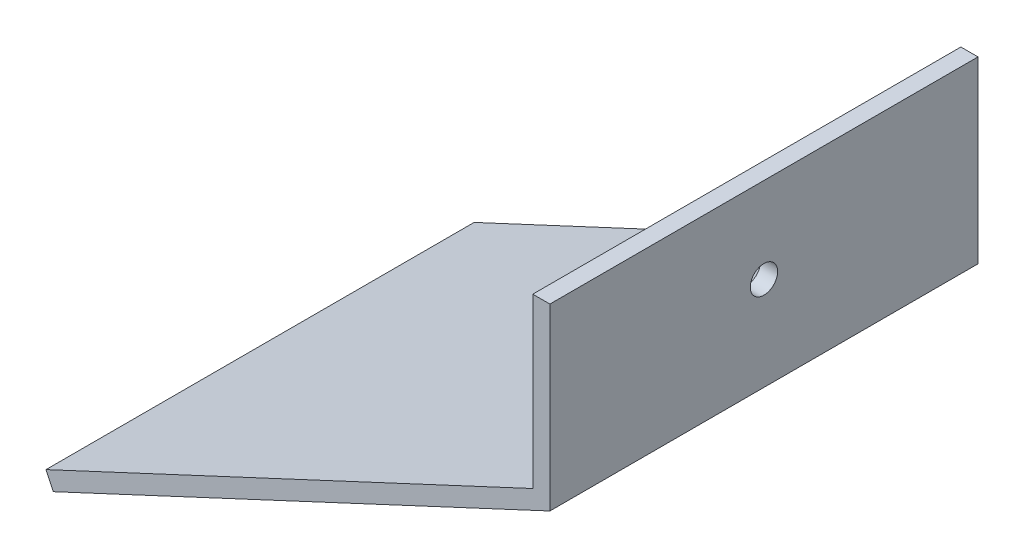
ISO-10303-21;
HEADER;
FILE_DESCRIPTION(('STEP AP214'),'2;1');
FILE_NAME('part.step','',(''),(''),'','','');
FILE_SCHEMA(('AUTOMOTIVE_DESIGN { 1 0 10303 214 1 1 1 1 }'));
ENDSEC;
DATA;
#1=APPLICATION_CONTEXT('core data for automotive mechanical design processes');
#2=APPLICATION_PROTOCOL_DEFINITION('international standard','automotive_design',2000,#1);
#3=PRODUCT_CONTEXT('',#1,'mechanical');
#4=PRODUCT('Part','Part','',(#3));
#5=PRODUCT_RELATED_PRODUCT_CATEGORY('part','',(#4));
#6=PRODUCT_DEFINITION_FORMATION('','',#4);
#7=PRODUCT_DEFINITION_CONTEXT('part definition',#1,'design');
#8=PRODUCT_DEFINITION('design','',#6,#7);
#9=PRODUCT_DEFINITION_SHAPE('','',#8);
#10=(LENGTH_UNIT() NAMED_UNIT(*) SI_UNIT(.MILLI.,.METRE.));
#11=(NAMED_UNIT(*) PLANE_ANGLE_UNIT() SI_UNIT($,.RADIAN.));
#12=(NAMED_UNIT(*) SI_UNIT($,.STERADIAN.) SOLID_ANGLE_UNIT());
#13=UNCERTAINTY_MEASURE_WITH_UNIT(LENGTH_MEASURE(1.E-05),#10,'distance_accuracy_value','');
#14=(GEOMETRIC_REPRESENTATION_CONTEXT(3) GLOBAL_UNCERTAINTY_ASSIGNED_CONTEXT((#13)) GLOBAL_UNIT_ASSIGNED_CONTEXT((#10,
#11,#12)) REPRESENTATION_CONTEXT('',''));
#15=CARTESIAN_POINT('',(0.,0.,0.));
#16=DIRECTION('',(0.,0.,1.));
#17=DIRECTION('',(1.,0.,0.));
#18=AXIS2_PLACEMENT_3D('',#15,#16,#17);
#19=CARTESIAN_POINT('',(0.845236523481395,-1.8126155740733,25.));
#20=DIRECTION('',(0.906307787036651,0.422618261740697,0.));
#21=DIRECTION('',(-0.422618261740697,0.906307787036651,0.));
#22=AXIS2_PLACEMENT_3D('',#19,#20,#21);
#23=PLANE('',#22);
#24=DIRECTION('',(0.422618261740697,-0.906307787036651,0.));
#25=VECTOR('',#24,1.);
#26=CARTESIAN_POINT('',(0.845236523481395,-1.8126155740733,-25.));
#27=LINE('',#26,#25);
#28=CARTESIAN_POINT('',(0.,0.,-25.));
#29=VERTEX_POINT('',#28);
#30=CARTESIAN_POINT('',(0.845236523481395,-1.8126155740733,-25.));
#31=VERTEX_POINT('',#30);
#32=EDGE_CURVE('E129',#29,#31,#27,.T.);
#33=ORIENTED_EDGE('',*,*,#32,.T.);
#34=DIRECTION('',(0.,0.,-1.));
#35=VECTOR('',#34,1.);
#36=CARTESIAN_POINT('',(0.845236523481395,-1.8126155740733,25.));
#37=LINE('',#36,#35);
#38=CARTESIAN_POINT('',(0.845236523481395,-1.8126155740733,25.));
#39=VERTEX_POINT('',#38);
#40=EDGE_CURVE('E11',#39,#31,#37,.T.);
#41=ORIENTED_EDGE('',*,*,#40,.F.);
#42=DIRECTION('',(0.422618261740697,-0.906307787036651,0.));
#43=VECTOR('',#42,1.);
#44=CARTESIAN_POINT('',(0.845236523481395,-1.8126155740733,25.));
#45=LINE('',#44,#43);
#46=CARTESIAN_POINT('',(0.,0.,25.));
#47=VERTEX_POINT('',#46);
#48=EDGE_CURVE('E145',#47,#39,#45,.T.);
#49=ORIENTED_EDGE('',*,*,#48,.F.);
#50=DIRECTION('',(0.,0.,-1.));
#51=VECTOR('',#50,1.);
#52=CARTESIAN_POINT('',(0.,0.,25.));
#53=LINE('',#52,#51);
#54=EDGE_CURVE('E125',#47,#29,#53,.T.);
#55=ORIENTED_EDGE('',*,*,#54,.T.);
#56=EDGE_LOOP('',(#33,#41,#49,#55));
#57=FACE_BOUND('',#56,.T.);
#58=ADVANCED_FACE('F39',(#57),#23,.F.);
#59=CARTESIAN_POINT('',(58.848934893827,25.2349531773313,25.));
#60=DIRECTION('',(-0.422618261740697,0.906307787036651,0.));
#61=DIRECTION('',(-0.906307787036651,-0.422618261740697,0.));
#62=AXIS2_PLACEMENT_3D('',#59,#60,#61);
#63=PLANE('',#62);
#64=DIRECTION('',(0.906307787036651,0.422618261740697,0.));
#65=VECTOR('',#64,1.);
#66=CARTESIAN_POINT('',(58.848934893827,25.2349531773313,-25.));
#67=LINE('',#66,#65);
#68=CARTESIAN_POINT('',(58.848934893827,25.2349531773313,-25.));
#69=VERTEX_POINT('',#68);
#70=EDGE_CURVE('E133',#31,#69,#67,.T.);
#71=ORIENTED_EDGE('',*,*,#70,.T.);
#72=DIRECTION('',(0.,0.,-1.));
#73=VECTOR('',#72,1.);
#74=CARTESIAN_POINT('',(58.848934893827,25.2349531773313,25.));
#75=LINE('',#74,#73);
#76=CARTESIAN_POINT('',(58.848934893827,25.2349531773313,25.));
#77=VERTEX_POINT('',#76);
#78=EDGE_CURVE('E49',#77,#69,#75,.T.);
#79=ORIENTED_EDGE('',*,*,#78,.F.);
#80=DIRECTION('',(0.906307787036651,0.422618261740697,0.));
#81=VECTOR('',#80,1.);
#82=CARTESIAN_POINT('',(58.848934893827,25.2349531773313,25.));
#83=LINE('',#82,#81);
#84=EDGE_CURVE('E94',#39,#77,#83,.T.);
#85=ORIENTED_EDGE('',*,*,#84,.F.);
#86=ORIENTED_EDGE('',*,*,#40,.T.);
#87=EDGE_LOOP('',(#71,#79,#85,#86));
#88=FACE_BOUND('',#87,.T.);
#89=ADVANCED_FACE('F175',(#88),#63,.F.);
#90=CARTESIAN_POINT('',(58.848934893827,46.1670321852684,25.));
#91=DIRECTION('',(-1.,0.,0.));
#92=DIRECTION('',(0.,-1.,0.));
#93=AXIS2_PLACEMENT_3D('',#90,#91,#92);
#94=PLANE('',#93);
#95=CARTESIAN_POINT('',(58.8489348938271,36.1670321852684,0.));
#96=DIRECTION('',(1.,0.,0.));
#97=DIRECTION('',(0.,0.,-1.));
#98=AXIS2_PLACEMENT_3D('',#95,#96,#97);
#99=CIRCLE('',#98,1.6);
#100=CARTESIAN_POINT('',(58.8489348938271,36.1670321852684,-1.6));
#101=VERTEX_POINT('',#100);
#102=EDGE_CURVE('E230',#101,#101,#99,.T.);
#103=ORIENTED_EDGE('',*,*,#102,.F.);
#104=EDGE_LOOP('',(#103));
#105=FACE_BOUND('',#104,.T.);
#106=DIRECTION('',(0.,1.,0.));
#107=VECTOR('',#106,1.);
#108=CARTESIAN_POINT('',(58.848934893827,46.1670321852684,-25.));
#109=LINE('',#108,#107);
#110=CARTESIAN_POINT('',(58.848934893827,46.1670321852684,-25.));
#111=VERTEX_POINT('',#110);
#112=EDGE_CURVE('E136',#69,#111,#109,.T.);
#113=ORIENTED_EDGE('',*,*,#112,.T.);
#114=DIRECTION('',(0.,0.,-1.));
#115=VECTOR('',#114,1.);
#116=CARTESIAN_POINT('',(58.848934893827,46.1670321852684,25.));
#117=LINE('',#116,#115);
#118=CARTESIAN_POINT('',(58.848934893827,46.1670321852684,25.));
#119=VERTEX_POINT('',#118);
#120=EDGE_CURVE('E118',#119,#111,#117,.T.);
#121=ORIENTED_EDGE('',*,*,#120,.F.);
#122=DIRECTION('',(0.,1.,0.));
#123=VECTOR('',#122,1.);
#124=CARTESIAN_POINT('',(58.848934893827,46.1670321852684,25.));
#125=LINE('',#124,#123);
#126=EDGE_CURVE('E107',#77,#119,#125,.T.);
#127=ORIENTED_EDGE('',*,*,#126,.F.);
#128=ORIENTED_EDGE('',*,*,#78,.T.);
#129=EDGE_LOOP('',(#113,#121,#127,#128));
#130=FACE_BOUND('',#129,.T.);
#131=ADVANCED_FACE('F156',(#105,#130),#94,.F.);
#132=CARTESIAN_POINT('',(56.848934893827,46.1670321852684,25.));
#133=DIRECTION('',(0.,-1.,0.));
#134=DIRECTION('',(0.,0.,-1.));
#135=AXIS2_PLACEMENT_3D('',#132,#133,#134);
#136=PLANE('',#135);
#137=DIRECTION('',(-1.,0.,0.));
#138=VECTOR('',#137,1.);
#139=CARTESIAN_POINT('',(56.848934893827,46.1670321852684,-25.));
#140=LINE('',#139,#138);
#141=CARTESIAN_POINT('',(56.848934893827,46.1670321852684,-25.));
#142=VERTEX_POINT('',#141);
#143=EDGE_CURVE('E116',#111,#142,#140,.T.);
#144=ORIENTED_EDGE('',*,*,#143,.T.);
#145=DIRECTION('',(0.,0.,-1.));
#146=VECTOR('',#145,1.);
#147=CARTESIAN_POINT('',(56.848934893827,46.1670321852684,25.));
#148=LINE('',#147,#146);
#149=CARTESIAN_POINT('',(56.848934893827,46.1670321852684,25.));
#150=VERTEX_POINT('',#149);
#151=EDGE_CURVE('E113',#150,#142,#148,.T.);
#152=ORIENTED_EDGE('',*,*,#151,.F.);
#153=DIRECTION('',(-1.,0.,0.));
#154=VECTOR('',#153,1.);
#155=CARTESIAN_POINT('',(56.848934893827,46.1670321852684,25.));
#156=LINE('',#155,#154);
#157=EDGE_CURVE('E101',#119,#150,#156,.T.);
#158=ORIENTED_EDGE('',*,*,#157,.F.);
#159=ORIENTED_EDGE('',*,*,#120,.T.);
#160=EDGE_LOOP('',(#144,#152,#158,#159));
#161=FACE_BOUND('',#160,.T.);
#162=ADVANCED_FACE('F114',(#161),#136,.F.);
#163=CARTESIAN_POINT('',(56.848934893827,26.5090936989463,25.));
#164=DIRECTION('',(1.,0.,0.));
#165=DIRECTION('',(0.,0.,-1.));
#166=AXIS2_PLACEMENT_3D('',#163,#164,#165);
#167=PLANE('',#166);
#168=CARTESIAN_POINT('',(56.848934893827,36.1670321852684,0.));
#169=DIRECTION('',(1.,0.,0.));
#170=DIRECTION('',(0.,0.,-1.));
#171=AXIS2_PLACEMENT_3D('',#168,#169,#170);
#172=CIRCLE('',#171,1.6);
#173=CARTESIAN_POINT('',(56.848934893827,36.1670321852684,-1.6));
#174=VERTEX_POINT('',#173);
#175=EDGE_CURVE('E42',#174,#174,#172,.T.);
#176=ORIENTED_EDGE('',*,*,#175,.T.);
#177=EDGE_LOOP('',(#176));
#178=FACE_BOUND('',#177,.T.);
#179=DIRECTION('',(0.,-1.,0.));
#180=VECTOR('',#179,1.);
#181=CARTESIAN_POINT('',(56.848934893827,26.5090936989463,-25.));
#182=LINE('',#181,#180);
#183=CARTESIAN_POINT('',(56.848934893827,26.5090936989463,-25.));
#184=VERTEX_POINT('',#183);
#185=EDGE_CURVE('E80',#142,#184,#182,.T.);
#186=ORIENTED_EDGE('',*,*,#185,.T.);
#187=DIRECTION('',(0.,0.,-1.));
#188=VECTOR('',#187,1.);
#189=CARTESIAN_POINT('',(56.848934893827,26.5090936989463,25.));
#190=LINE('',#189,#188);
#191=CARTESIAN_POINT('',(56.848934893827,26.5090936989463,25.));
#192=VERTEX_POINT('',#191);
#193=EDGE_CURVE('E119',#192,#184,#190,.T.);
#194=ORIENTED_EDGE('',*,*,#193,.F.);
#195=DIRECTION('',(0.,-1.,0.));
#196=VECTOR('',#195,1.);
#197=CARTESIAN_POINT('',(56.848934893827,26.5090936989463,25.));
#198=LINE('',#197,#196);
#199=EDGE_CURVE('E105',#150,#192,#198,.T.);
#200=ORIENTED_EDGE('',*,*,#199,.F.);
#201=ORIENTED_EDGE('',*,*,#151,.T.);
#202=EDGE_LOOP('',(#186,#194,#200,#201));
#203=FACE_BOUND('',#202,.T.);
#204=ADVANCED_FACE('F121',(#178,#203),#167,.F.);
#205=CARTESIAN_POINT('',(0.,0.,25.));
#206=DIRECTION('',(0.422618261740697,-0.906307787036651,0.));
#207=DIRECTION('',(0.906307787036651,0.422618261740697,0.));
#208=AXIS2_PLACEMENT_3D('',#205,#206,#207);
#209=PLANE('',#208);
#210=DIRECTION('',(-0.906307787036651,-0.422618261740697,0.));
#211=VECTOR('',#210,1.);
#212=CARTESIAN_POINT('',(0.,0.,-25.));
#213=LINE('',#212,#211);
#214=EDGE_CURVE('E86',#184,#29,#213,.T.);
#215=ORIENTED_EDGE('',*,*,#214,.T.);
#216=ORIENTED_EDGE('',*,*,#54,.F.);
#217=DIRECTION('',(-0.906307787036651,-0.422618261740697,0.));
#218=VECTOR('',#217,1.);
#219=CARTESIAN_POINT('',(0.,0.,25.));
#220=LINE('',#219,#218);
#221=EDGE_CURVE('E57',#192,#47,#220,.T.);
#222=ORIENTED_EDGE('',*,*,#221,.F.);
#223=ORIENTED_EDGE('',*,*,#193,.T.);
#224=EDGE_LOOP('',(#215,#216,#222,#223));
#225=FACE_BOUND('',#224,.T.);
#226=ADVANCED_FACE('F163',(#225),#209,.F.);
#227=CARTESIAN_POINT('',(0.,0.,25.));
#228=DIRECTION('',(0.,0.,-1.));
#229=DIRECTION('',(-1.,0.,0.));
#230=AXIS2_PLACEMENT_3D('',#227,#228,#229);
#231=PLANE('',#230);
#232=ORIENTED_EDGE('',*,*,#48,.T.);
#233=ORIENTED_EDGE('',*,*,#84,.T.);
#234=ORIENTED_EDGE('',*,*,#126,.T.);
#235=ORIENTED_EDGE('',*,*,#157,.T.);
#236=ORIENTED_EDGE('',*,*,#199,.T.);
#237=ORIENTED_EDGE('',*,*,#221,.T.);
#238=EDGE_LOOP('',(#232,#233,#234,#235,#236,#237));
#239=FACE_BOUND('',#238,.T.);
#240=ADVANCED_FACE('F103',(#239),#231,.F.);
#241=CARTESIAN_POINT('',(0.,0.,-25.));
#242=DIRECTION('',(0.,0.,-1.));
#243=DIRECTION('',(-1.,0.,0.));
#244=AXIS2_PLACEMENT_3D('',#241,#242,#243);
#245=PLANE('',#244);
#246=ORIENTED_EDGE('',*,*,#32,.F.);
#247=ORIENTED_EDGE('',*,*,#214,.F.);
#248=ORIENTED_EDGE('',*,*,#185,.F.);
#249=ORIENTED_EDGE('',*,*,#143,.F.);
#250=ORIENTED_EDGE('',*,*,#112,.F.);
#251=ORIENTED_EDGE('',*,*,#70,.F.);
#252=EDGE_LOOP('',(#246,#247,#248,#249,#250,#251));
#253=FACE_BOUND('',#252,.T.);
#254=ADVANCED_FACE('F159',(#253),#245,.T.);
#255=CARTESIAN_POINT('',(8.84893489382706,36.1670321852684,0.));
#256=DIRECTION('',(1.,0.,0.));
#257=DIRECTION('',(0.,0.,-1.));
#258=AXIS2_PLACEMENT_3D('',#255,#256,#257);
#259=CYLINDRICAL_SURFACE('',#258,1.6);
#260=ORIENTED_EDGE('',*,*,#102,.T.);
#261=EDGE_LOOP('',(#260));
#262=FACE_BOUND('',#261,.T.);
#263=ORIENTED_EDGE('',*,*,#175,.F.);
#264=EDGE_LOOP('',(#263));
#265=FACE_BOUND('',#264,.T.);
#266=ADVANCED_FACE('F203',(#262,#265),#259,.F.);
#267=CLOSED_SHELL('',(#58,#89,#131,#162,#204,#226,#240,#254,#266));
#268=MANIFOLD_SOLID_BREP('B2',#267);
#269=ADVANCED_BREP_SHAPE_REPRESENTATION('',(#18,#268),#14);
#270=SHAPE_DEFINITION_REPRESENTATION(#9,#269);
ENDSEC;
END-ISO-10303-21;
